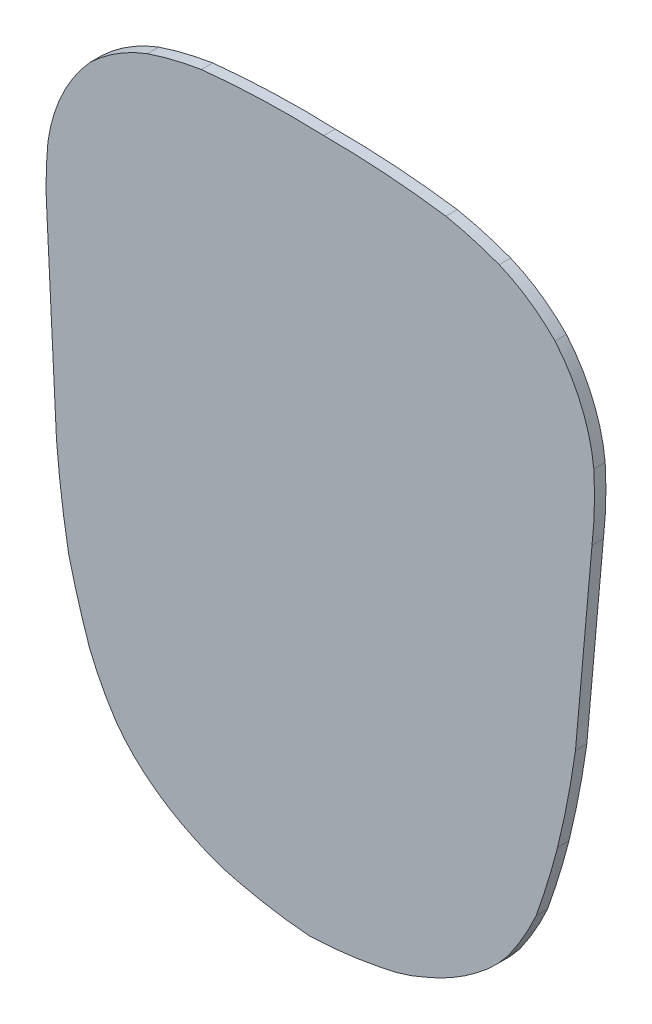
ISO-10303-21;
HEADER;
FILE_DESCRIPTION(('STEP AP214'),'2;1');
FILE_NAME('part.step','',(''),(''),'','','');
FILE_SCHEMA(('AUTOMOTIVE_DESIGN { 1 0 10303 214 1 1 1 1 }'));
ENDSEC;
DATA;
#1=APPLICATION_CONTEXT('core data for automotive mechanical design processes');
#2=APPLICATION_PROTOCOL_DEFINITION('international standard','automotive_design',2000,#1);
#3=PRODUCT_CONTEXT('',#1,'mechanical');
#4=PRODUCT('Part','Part','',(#3));
#5=PRODUCT_RELATED_PRODUCT_CATEGORY('part','',(#4));
#6=PRODUCT_DEFINITION_FORMATION('','',#4);
#7=PRODUCT_DEFINITION_CONTEXT('part definition',#1,'design');
#8=PRODUCT_DEFINITION('design','',#6,#7);
#9=PRODUCT_DEFINITION_SHAPE('','',#8);
#10=(LENGTH_UNIT() NAMED_UNIT(*) SI_UNIT(.MILLI.,.METRE.));
#11=(NAMED_UNIT(*) PLANE_ANGLE_UNIT() SI_UNIT($,.RADIAN.));
#12=(NAMED_UNIT(*) SI_UNIT($,.STERADIAN.) SOLID_ANGLE_UNIT());
#13=UNCERTAINTY_MEASURE_WITH_UNIT(LENGTH_MEASURE(1.E-05),#10,'distance_accuracy_value','');
#14=(GEOMETRIC_REPRESENTATION_CONTEXT(3) GLOBAL_UNCERTAINTY_ASSIGNED_CONTEXT((#13)) GLOBAL_UNIT_ASSIGNED_CONTEXT((#10,
#11,#12)) REPRESENTATION_CONTEXT('',''));
#15=CARTESIAN_POINT('',(0.,0.,0.));
#16=DIRECTION('',(0.,0.,1.));
#17=DIRECTION('',(1.,0.,0.));
#18=AXIS2_PLACEMENT_3D('',#15,#16,#17);
#19=CARTESIAN_POINT('',(-2.87645068487016,-22.2307778413905,37.7490965279302));
#20=DIRECTION('',(0.,0.,1.));
#21=DIRECTION('',(0.0193548335692301,0.999812677663925,0.));
#22=AXIS2_PLACEMENT_3D('',#19,#20,#21);
#23=PLANE('',#22);
#24=CARTESIAN_POINT('',(3.40605421210544,8.02001484887181,37.74909652793));
#25=DIRECTION('',(0.,0.,-1.));
#26=DIRECTION('',(-0.0193548335692301,-0.999812677663925,0.));
#27=AXIS2_PLACEMENT_3D('',#24,#25,#26);
#28=CIRCLE('',#27,7.43643173112);
#29=CARTESIAN_POINT('',(8.74976189327244,13.1916011731871,37.74909652793));
#30=VERTEX_POINT('',#29);
#31=CARTESIAN_POINT('',(6.29473617833669,14.8724621043842,37.74909652793));
#32=VERTEX_POINT('',#31);
#33=EDGE_CURVE('E399',#30,#32,#28,.F.);
#34=ORIENTED_EDGE('',*,*,#33,.F.);
#35=CARTESIAN_POINT('',(3.11803650286193,8.43130453548566,37.7490965279299));
#36=DIRECTION('',(0.,0.,-1.));
#37=DIRECTION('',(-0.0193548335692301,-0.999812677663925,0.));
#38=AXIS2_PLACEMENT_3D('',#35,#36,#37);
#39=CIRCLE('',#38,7.3740595978);
#40=CARTESIAN_POINT('',(10.4553019723894,9.16702892789532,37.7490965279302));
#41=VERTEX_POINT('',#40);
#42=EDGE_CURVE('E194',#41,#30,#39,.F.);
#43=ORIENTED_EDGE('',*,*,#42,.F.);
#44=CARTESIAN_POINT('',(-6.32552371849095,8.14421174061835,37.7490965279296));
#45=DIRECTION('',(0.,0.,-1.));
#46=DIRECTION('',(-0.0193548335692301,-0.999812677663925,0.));
#47=AXIS2_PLACEMENT_3D('',#44,#45,#46);
#48=CIRCLE('',#47,16.81196793556);
#49=CARTESIAN_POINT('',(10.3766044314373,6.2255713027891,37.7490965279302));
#50=VERTEX_POINT('',#49);
#51=EDGE_CURVE('E20',#50,#41,#48,.F.);
#52=ORIENTED_EDGE('',*,*,#51,.F.);
#53=DIRECTION('',(-0.0886995040357044,-0.996058431008854,0.));
#54=VECTOR('',#53,1.);
#55=CARTESIAN_POINT('',(10.3766044314373,6.22557130278913,37.7490965279302));
#56=LINE('',#55,#54);
#57=CARTESIAN_POINT('',(9.64811099468481,-1.95510611475094,37.7490965279302));
#58=VERTEX_POINT('',#57);
#59=EDGE_CURVE('E193',#50,#58,#56,.T.);
#60=ORIENTED_EDGE('',*,*,#59,.T.);
#61=CARTESIAN_POINT('',(-31.2814474166911,3.80134354731966,37.7490965279289));
#62=DIRECTION('',(0.,0.,-1.));
#63=DIRECTION('',(-0.0193548335692301,-0.999812677663925,0.));
#64=AXIS2_PLACEMENT_3D('',#61,#62,#63);
#65=CIRCLE('',#64,41.33237791928);
#66=CARTESIAN_POINT('',(8.86403234955447,-6.03257321052169,37.7490965279303));
#67=VERTEX_POINT('',#66);
#68=EDGE_CURVE('E206',#67,#58,#65,.F.);
#69=ORIENTED_EDGE('',*,*,#68,.F.);
#70=CARTESIAN_POINT('',(-24.973760623793,2.68335405814088,37.7490965279291));
#71=DIRECTION('',(0.,0.,-1.));
#72=DIRECTION('',(-0.0193548335692301,-0.999812677663925,0.));
#73=AXIS2_PLACEMENT_3D('',#70,#71,#72);
#74=CIRCLE('',#73,34.94228987144);
#75=CARTESIAN_POINT('',(7.91947678147986,-9.10641075970419,37.7490965279303));
#76=VERTEX_POINT('',#75);
#77=EDGE_CURVE('E320',#76,#67,#74,.F.);
#78=ORIENTED_EDGE('',*,*,#77,.F.);
#79=CARTESIAN_POINT('',(-3.58067037627299,-3.93497982202906,37.7490965279299));
#80=DIRECTION('',(0.,0.,-1.));
#81=DIRECTION('',(-0.0193548335692301,-0.999812677663925,0.));
#82=AXIS2_PLACEMENT_3D('',#79,#80,#81);
#83=CIRCLE('',#82,12.60940452968);
#84=CARTESIAN_POINT('',(6.6977668305515,-11.2391437836663,37.7490965279303));
#85=VERTEX_POINT('',#84);
#86=EDGE_CURVE('E324',#85,#76,#83,.F.);
#87=ORIENTED_EDGE('',*,*,#86,.F.);
#88=CARTESIAN_POINT('',(1.10266886694143,-6.8693447401081,37.74909652793));
#89=DIRECTION('',(0.,0.,-1.));
#90=DIRECTION('',(-0.0193548335692301,-0.999812677663925,0.));
#91=AXIS2_PLACEMENT_3D('',#88,#89,#90);
#92=CIRCLE('',#91,7.09931439672);
#93=CARTESIAN_POINT('',(5.30083998115867,-12.5943446701717,37.7490965279303));
#94=VERTEX_POINT('',#93);
#95=EDGE_CURVE('E328',#94,#85,#92,.F.);
#96=ORIENTED_EDGE('',*,*,#95,.F.);
#97=CARTESIAN_POINT('',(-0.638723059391806,-4.8395373063229,37.74909652793));
#98=DIRECTION('',(0.,0.,-1.));
#99=DIRECTION('',(-0.0193548335692301,-0.999812677663925,0.));
#100=AXIS2_PLACEMENT_3D('',#97,#98,#99);
#101=CIRCLE('',#100,9.76808304444);
#102=CARTESIAN_POINT('',(3.02325465351682,-13.8952187049387,37.7490965279302));
#103=VERTEX_POINT('',#102);
#104=EDGE_CURVE('E332',#103,#94,#101,.F.);
#105=ORIENTED_EDGE('',*,*,#104,.F.);
#106=CARTESIAN_POINT('',(-0.207770559998101,-6.83732878190939,37.74909652793));
#107=DIRECTION('',(0.,0.,-1.));
#108=DIRECTION('',(-0.0193548335692301,-0.999812677663925,0.));
#109=AXIS2_PLACEMENT_3D('',#106,#107,#108);
#110=CIRCLE('',#109,7.76230211316);
#111=CARTESIAN_POINT('',(1.1176538211111,-14.4856347581325,37.7490965279302));
#112=VERTEX_POINT('',#111);
#113=EDGE_CURVE('E336',#112,#103,#110,.F.);
#114=ORIENTED_EDGE('',*,*,#113,.F.);
#115=CARTESIAN_POINT('',(-2.80966912930586,4.75500909683406,37.7490965279298));
#116=DIRECTION('',(0.,0.,-1.));
#117=DIRECTION('',(-0.0193548335692301,-0.999812677663925,0.));
#118=AXIS2_PLACEMENT_3D('',#115,#116,#117);
#119=CIRCLE('',#118,19.6373684976);
#120=CARTESIAN_POINT('',(-2.01526832310904,-14.8662846645275,37.7490965279301));
#121=VERTEX_POINT('',#120);
#122=EDGE_CURVE('E340',#121,#112,#119,.F.);
#123=ORIENTED_EDGE('',*,*,#122,.F.);
#124=CARTESIAN_POINT('',(-0.523207579480535,4.71400533480674,37.7490965279299));
#125=DIRECTION('',(0.,0.,-1.));
#126=DIRECTION('',(-0.0193548335692301,-0.999812677663925,0.));
#127=AXIS2_PLACEMENT_3D('',#124,#125,#126);
#128=CIRCLE('',#127,19.63705684976);
#129=CARTESIAN_POINT('',(-5.17633782189552,-14.3637927736708,37.74909652793));
#130=VERTEX_POINT('',#129);
#131=EDGE_CURVE('E344',#130,#121,#128,.F.);
#132=ORIENTED_EDGE('',*,*,#131,.F.);
#133=CARTESIAN_POINT('',(-3.55589855490548,-6.77251418057695,37.7490965279299));
#134=DIRECTION('',(0.,0.,-1.));
#135=DIRECTION('',(-0.0193548335692301,-0.999812677663925,0.));
#136=AXIS2_PLACEMENT_3D('',#133,#134,#135);
#137=CIRCLE('',#136,7.76230211316);
#138=CARTESIAN_POINT('',(-7.05766041396077,-13.7000677154429,37.7490965279299));
#139=VERTEX_POINT('',#138);
#140=EDGE_CURVE('E348',#139,#130,#137,.F.);
#141=ORIENTED_EDGE('',*,*,#140,.F.);
#142=CARTESIAN_POINT('',(-3.04794957670766,-4.7928983915392,37.7490965279299));
#143=DIRECTION('',(0.,0.,-1.));
#144=DIRECTION('',(-0.0193548335692301,-0.999812677663925,0.));
#145=AXIS2_PLACEMENT_3D('',#142,#143,#144);
#146=CIRCLE('',#145,9.76808304444);
#147=CARTESIAN_POINT('',(-9.28319236302824,-12.3120202657153,37.7490965279298));
#148=VERTEX_POINT('',#147);
#149=EDGE_CURVE('E352',#148,#139,#146,.F.);
#150=ORIENTED_EDGE('',*,*,#149,.F.);
#151=CARTESIAN_POINT('',(-4.76167465689586,-6.83879977530864,37.7490965279299));
#152=DIRECTION('',(0.,0.,-1.));
#153=DIRECTION('',(-0.0193548335692301,-0.999812677663925,0.));
#154=AXIS2_PLACEMENT_3D('',#151,#152,#153);
#155=CIRCLE('',#154,7.09931439672);
#156=CARTESIAN_POINT('',(-10.5813963887554,-10.9046457963968,37.7490965279298));
#157=VERTEX_POINT('',#156);
#158=EDGE_CURVE('E356',#157,#148,#155,.F.);
#159=ORIENTED_EDGE('',*,*,#158,.F.);
#160=CARTESIAN_POINT('',(-0.0279711922388365,-4.00375460651088,37.74909652793));
#161=DIRECTION('',(0.,0.,-1.));
#162=DIRECTION('',(-0.0193548335692301,-0.999812677663925,0.));
#163=AXIS2_PLACEMENT_3D('',#160,#161,#162);
#164=CIRCLE('',#163,12.60940452968);
#165=CARTESIAN_POINT('',(-11.7196490905639,-8.72622753019508,37.7490965279297));
#166=VERTEX_POINT('',#165);
#167=EDGE_CURVE('E360',#166,#157,#164,.F.);
#168=ORIENTED_EDGE('',*,*,#167,.F.);
#169=CARTESIAN_POINT('',(21.3074102324667,2.68328490166428,37.7490965279306));
#170=DIRECTION('',(0.,0.,-1.));
#171=DIRECTION('',(-0.0193548335692301,-0.999812677663925,0.));
#172=AXIS2_PLACEMENT_3D('',#169,#170,#171);
#173=CIRCLE('',#172,34.94228987144);
#174=CARTESIAN_POINT('',(-12.6348799299236,-5.61638738053116,37.7490965279296));
#175=VERTEX_POINT('',#174);
#176=EDGE_CURVE('E363',#175,#166,#173,.F.);
#177=ORIENTED_EDGE('',*,*,#176,.F.);
#178=CARTESIAN_POINT('',(28.0310735031444,1.77588533100571,37.7490965279308));
#179=DIRECTION('',(0.,0.,-1.));
#180=DIRECTION('',(-0.0193548335692301,-0.999812677663925,0.));
#181=AXIS2_PLACEMENT_3D('',#178,#179,#180);
#182=CIRCLE('',#181,41.33237791928);
#183=CARTESIAN_POINT('',(-13.1702154109103,-1.51337845938621,37.7490965279296));
#184=VERTEX_POINT('',#183);
#185=EDGE_CURVE('E367',#184,#175,#182,.F.);
#186=ORIENTED_EDGE('',*,*,#185,.F.);
#187=DIRECTION('',(-0.0500831809567765,0.998745050042928,0.));
#188=VECTOR('',#187,1.);
#189=CARTESIAN_POINT('',(-13.1702154109103,-1.51337845938582,37.7490965279296));
#190=LINE('',#189,#188);
#191=CARTESIAN_POINT('',(-13.5815510662259,6.68936429385876,37.7490965279294));
#192=VERTEX_POINT('',#191);
#193=EDGE_CURVE('E219',#184,#192,#190,.T.);
#194=ORIENTED_EDGE('',*,*,#193,.T.);
#195=CARTESIAN_POINT('',(3.18231954948581,7.96015453853926,37.74909652793));
#196=DIRECTION('',(0.,0.,-1.));
#197=DIRECTION('',(-0.0193548335692301,-0.999812677663925,0.));
#198=AXIS2_PLACEMENT_3D('',#195,#196,#197);
#199=CIRCLE('',#198,16.81196793556);
#200=CARTESIAN_POINT('',(-13.5463481289565,9.63166390750369,37.7490965279294));
#201=VERTEX_POINT('',#200);
#202=EDGE_CURVE('E223',#201,#192,#199,.F.);
#203=ORIENTED_EDGE('',*,*,#202,.F.);
#204=CARTESIAN_POINT('',(-6.24305419079941,8.61252083374827,37.7490965279296));
#205=DIRECTION('',(0.,0.,-1.));
#206=DIRECTION('',(-0.0193548335692301,-0.999812677663925,0.));
#207=AXIS2_PLACEMENT_3D('',#204,#205,#206);
#208=CIRCLE('',#207,7.3740595978);
#209=CARTESIAN_POINT('',(-11.6863252040826,13.5872123445715,37.7490965279294));
#210=VERTEX_POINT('',#209);
#211=EDGE_CURVE('E375',#210,#201,#208,.F.);
#212=ORIENTED_EDGE('',*,*,#211,.F.);
#213=CARTESIAN_POINT('',(-6.54677401618388,8.21268627443502,37.7490965279296));
#214=DIRECTION('',(0.,0.,-1.));
#215=DIRECTION('',(-0.0193548335692301,-0.999812677663925,0.));
#216=AXIS2_PLACEMENT_3D('',#213,#214,#215);
#217=CIRCLE('',#216,7.43643173112);
#218=CARTESIAN_POINT('',(-9.16808546254458,15.17179851615,37.7490965279295));
#219=VERTEX_POINT('',#218);
#220=EDGE_CURVE('E379',#219,#210,#217,.F.);
#221=ORIENTED_EDGE('',*,*,#220,.F.);
#222=CARTESIAN_POINT('',(-4.43670572158507,1.02428534892829,37.7490965279298));
#223=DIRECTION('',(0.,0.,-1.));
#224=DIRECTION('',(-0.0193548335692301,-0.999812677663925,0.));
#225=AXIS2_PLACEMENT_3D('',#222,#223,#224);
#226=CIRCLE('',#225,14.91771038296);
#227=CARTESIAN_POINT('',(-6.80003650135269,15.7536013783736,37.7490965279295));
#228=VERTEX_POINT('',#227);
#229=EDGE_CURVE('E383',#228,#219,#226,.F.);
#230=ORIENTED_EDGE('',*,*,#229,.F.);
#231=CARTESIAN_POINT('',(-2.87645068487016,-22.2307778413905,37.7490965279302));
#232=DIRECTION('',(0.,0.,-1.));
#233=DIRECTION('',(-0.0193548335692301,-0.999812677663925,0.));
#234=AXIS2_PLACEMENT_3D('',#231,#232,#233);
#235=CIRCLE('',#234,38.18648439396);
#236=CARTESIAN_POINT('',(-1.41914055333809,15.9278887698878,37.7490965279297));
#237=VERTEX_POINT('',#236);
#238=EDGE_CURVE('E387',#237,#228,#235,.F.);
#239=ORIENTED_EDGE('',*,*,#238,.F.);
#240=CARTESIAN_POINT('',(-1.43975485684205,-22.2585901013477,37.7490965279302));
#241=DIRECTION('',(0.,0.,-1.));
#242=DIRECTION('',(-0.0193548335692301,-0.999812677663925,0.));
#243=AXIS2_PLACEMENT_3D('',#240,#241,#242);
#244=CIRCLE('',#243,38.186484435371);
#245=CARTESIAN_POINT('',(3.95097858118662,15.5454782846467,37.7490965279299));
#246=VERTEX_POINT('',#245);
#247=EDGE_CURVE('E391',#246,#237,#244,.F.);
#248=ORIENTED_EDGE('',*,*,#247,.F.);
#249=CARTESIAN_POINT('',(1.01935833845516,0.918664351931265,37.74909652793));
#250=DIRECTION('',(0.,0.,-1.));
#251=DIRECTION('',(-0.0193548335692301,-0.999812677663925,0.));
#252=AXIS2_PLACEMENT_3D('',#249,#250,#251);
#253=CIRCLE('',#252,14.91771038296);
#254=EDGE_CURVE('E395',#32,#246,#253,.F.);
#255=ORIENTED_EDGE('',*,*,#254,.F.);
#256=EDGE_LOOP('',(#34,#43,#52,#60,#69,#78,#87,#96,#105,#114,#123,#132,#141,#150,#159,#168,#177,
#186,#194,#203,#212,#221,#230,#239,#248,#255));
#257=FACE_BOUND('',#256,.T.);
#258=ADVANCED_FACE('F17',(#257),#23,.F.);
#259=CARTESIAN_POINT('',(-6.32552371849096,8.14421174061835,38.1300965279296));
#260=DIRECTION('',(0.,0.,-1.));
#261=DIRECTION('',(-0.0193548335692301,-0.999812677663925,0.));
#262=AXIS2_PLACEMENT_3D('',#259,#260,#261);
#263=CYLINDRICAL_SURFACE('',#262,16.81196793556);
#264=DIRECTION('',(0.,0.,-1.));
#265=VECTOR('',#264,1.);
#266=CARTESIAN_POINT('',(10.4553019723893,9.16702892789537,38.1300965279302));
#267=LINE('',#266,#265);
#268=CARTESIAN_POINT('',(10.4553019723893,9.16702892789536,38.2500965279301));
#269=VERTEX_POINT('',#268);
#270=EDGE_CURVE('E198',#269,#41,#267,.T.);
#271=ORIENTED_EDGE('',*,*,#270,.F.);
#272=CARTESIAN_POINT('',(-6.32552371849096,8.14421174061835,38.2500965279296));
#273=DIRECTION('',(0.,0.,-1.));
#274=DIRECTION('',(-0.0193548335692301,-0.999812677663925,0.));
#275=AXIS2_PLACEMENT_3D('',#272,#273,#274);
#276=CIRCLE('',#275,16.81196793556);
#277=CARTESIAN_POINT('',(10.3766044314372,6.22557130278923,38.2500965279302));
#278=VERTEX_POINT('',#277);
#279=EDGE_CURVE('E203',#278,#269,#276,.F.);
#280=ORIENTED_EDGE('',*,*,#279,.F.);
#281=DIRECTION('',(0.,0.,1.));
#282=VECTOR('',#281,1.);
#283=CARTESIAN_POINT('',(10.3766044314372,6.22557130278915,38.1300965279302));
#284=LINE('',#283,#282);
#285=EDGE_CURVE('E200',#278,#50,#284,.F.);
#286=ORIENTED_EDGE('',*,*,#285,.T.);
#287=ORIENTED_EDGE('',*,*,#51,.T.);
#288=EDGE_LOOP('',(#271,#280,#286,#287));
#289=FACE_BOUND('',#288,.T.);
#290=ADVANCED_FACE('F201',(#289),#263,.T.);
#291=CARTESIAN_POINT('',(3.11803650286192,8.43130453548566,38.1300965279299));
#292=DIRECTION('',(0.,0.,-1.));
#293=DIRECTION('',(-0.0193548335692301,-0.999812677663925,0.));
#294=AXIS2_PLACEMENT_3D('',#291,#292,#293);
#295=CYLINDRICAL_SURFACE('',#294,7.3740595978);
#296=DIRECTION('',(0.,0.,-1.));
#297=VECTOR('',#296,1.);
#298=CARTESIAN_POINT('',(8.74976189327242,13.1916011731871,38.13009652793));
#299=LINE('',#298,#297);
#300=CARTESIAN_POINT('',(8.74976189327242,13.1916011731871,38.25009652793));
#301=VERTEX_POINT('',#300);
#302=EDGE_CURVE('E401',#301,#30,#299,.T.);
#303=ORIENTED_EDGE('',*,*,#302,.F.);
#304=CARTESIAN_POINT('',(3.11803650286191,8.43130453548566,38.2500965279299));
#305=DIRECTION('',(0.,0.,-1.));
#306=DIRECTION('',(-0.0193548335692301,-0.999812677663925,0.));
#307=AXIS2_PLACEMENT_3D('',#304,#305,#306);
#308=CIRCLE('',#307,7.3740595978);
#309=EDGE_CURVE('E311',#269,#301,#308,.F.);
#310=ORIENTED_EDGE('',*,*,#309,.F.);
#311=ORIENTED_EDGE('',*,*,#270,.T.);
#312=ORIENTED_EDGE('',*,*,#42,.T.);
#313=EDGE_LOOP('',(#303,#310,#311,#312));
#314=FACE_BOUND('',#313,.T.);
#315=ADVANCED_FACE('F409',(#314),#295,.T.);
#316=CARTESIAN_POINT('',(3.40605421210543,8.02001484887182,38.13009652793));
#317=DIRECTION('',(0.,0.,-1.));
#318=DIRECTION('',(-0.0193548335692301,-0.999812677663925,0.));
#319=AXIS2_PLACEMENT_3D('',#316,#317,#318);
#320=CYLINDRICAL_SURFACE('',#319,7.43643173112);
#321=DIRECTION('',(0.,0.,-1.));
#322=VECTOR('',#321,1.);
#323=CARTESIAN_POINT('',(6.29473617833669,14.8724621043842,38.13009652793));
#324=LINE('',#323,#322);
#325=CARTESIAN_POINT('',(6.29473617833668,14.8724621043842,38.2500965279299));
#326=VERTEX_POINT('',#325);
#327=EDGE_CURVE('E398',#326,#32,#324,.T.);
#328=ORIENTED_EDGE('',*,*,#327,.F.);
#329=CARTESIAN_POINT('',(3.40605421210542,8.02001484887182,38.2500965279299));
#330=DIRECTION('',(0.,0.,-1.));
#331=DIRECTION('',(-0.0193548335692301,-0.999812677663925,0.));
#332=AXIS2_PLACEMENT_3D('',#329,#330,#331);
#333=CIRCLE('',#332,7.43643173112);
#334=EDGE_CURVE('E307',#301,#326,#333,.F.);
#335=ORIENTED_EDGE('',*,*,#334,.F.);
#336=ORIENTED_EDGE('',*,*,#302,.T.);
#337=ORIENTED_EDGE('',*,*,#33,.T.);
#338=EDGE_LOOP('',(#328,#335,#336,#337));
#339=FACE_BOUND('',#338,.T.);
#340=ADVANCED_FACE('F486',(#339),#320,.T.);
#341=CARTESIAN_POINT('',(1.01935833845515,0.918664351931272,38.13009652793));
#342=DIRECTION('',(0.,0.,-1.));
#343=DIRECTION('',(-0.0193548335692301,-0.999812677663925,0.));
#344=AXIS2_PLACEMENT_3D('',#341,#342,#343);
#345=CYLINDRICAL_SURFACE('',#344,14.91771038296);
#346=DIRECTION('',(0.,0.,-1.));
#347=VECTOR('',#346,1.);
#348=CARTESIAN_POINT('',(3.95097858118664,15.5454782846467,38.1300965279299));
#349=LINE('',#348,#347);
#350=CARTESIAN_POINT('',(3.95097858118661,15.5454782846467,38.2500965279298));
#351=VERTEX_POINT('',#350);
#352=EDGE_CURVE('E394',#351,#246,#349,.T.);
#353=ORIENTED_EDGE('',*,*,#352,.F.);
#354=CARTESIAN_POINT('',(1.01935833845515,0.918664351931274,38.2500965279299));
#355=DIRECTION('',(0.,0.,-1.));
#356=DIRECTION('',(-0.0193548335692301,-0.999812677663925,0.));
#357=AXIS2_PLACEMENT_3D('',#354,#355,#356);
#358=CIRCLE('',#357,14.91771038296);
#359=EDGE_CURVE('E303',#326,#351,#358,.F.);
#360=ORIENTED_EDGE('',*,*,#359,.F.);
#361=ORIENTED_EDGE('',*,*,#327,.T.);
#362=ORIENTED_EDGE('',*,*,#254,.T.);
#363=EDGE_LOOP('',(#353,#360,#361,#362));
#364=FACE_BOUND('',#363,.T.);
#365=ADVANCED_FACE('F482',(#364),#345,.T.);
#366=CARTESIAN_POINT('',(-1.43975485684206,-22.2585901013477,38.1300965279302));
#367=DIRECTION('',(0.,0.,-1.));
#368=DIRECTION('',(-0.0193548335692301,-0.999812677663925,0.));
#369=AXIS2_PLACEMENT_3D('',#366,#367,#368);
#370=CYLINDRICAL_SURFACE('',#369,38.186484435371);
#371=DIRECTION('',(0.,0.,-1.));
#372=VECTOR('',#371,1.);
#373=CARTESIAN_POINT('',(-1.41914055333799,15.9278887698878,38.1300965279297));
#374=LINE('',#373,#372);
#375=CARTESIAN_POINT('',(-1.4191405533381,15.9278887698878,38.2500965279296));
#376=VERTEX_POINT('',#375);
#377=EDGE_CURVE('E390',#376,#237,#374,.T.);
#378=ORIENTED_EDGE('',*,*,#377,.F.);
#379=CARTESIAN_POINT('',(-1.43975485684206,-22.2585901013477,38.2500965279302));
#380=DIRECTION('',(0.,0.,-1.));
#381=DIRECTION('',(-0.0193548335692301,-0.999812677663925,0.));
#382=AXIS2_PLACEMENT_3D('',#379,#380,#381);
#383=CIRCLE('',#382,38.186484435371);
#384=EDGE_CURVE('E299',#351,#376,#383,.F.);
#385=ORIENTED_EDGE('',*,*,#384,.F.);
#386=ORIENTED_EDGE('',*,*,#352,.T.);
#387=ORIENTED_EDGE('',*,*,#247,.T.);
#388=EDGE_LOOP('',(#378,#385,#386,#387));
#389=FACE_BOUND('',#388,.T.);
#390=ADVANCED_FACE('F491',(#389),#370,.T.);
#391=CARTESIAN_POINT('',(-2.87645068487017,-22.2307778413905,38.1300965279302));
#392=DIRECTION('',(0.,0.,-1.));
#393=DIRECTION('',(-0.0193548335692301,-0.999812677663925,0.));
#394=AXIS2_PLACEMENT_3D('',#391,#392,#393);
#395=CYLINDRICAL_SURFACE('',#394,38.18648439396);
#396=DIRECTION('',(0.,0.,-1.));
#397=VECTOR('',#396,1.);
#398=CARTESIAN_POINT('',(-6.80003650135271,15.7536013783736,38.1300965279295));
#399=LINE('',#398,#397);
#400=CARTESIAN_POINT('',(-6.80003650135273,15.7536013783736,38.2500965279295));
#401=VERTEX_POINT('',#400);
#402=EDGE_CURVE('E386',#401,#228,#399,.T.);
#403=ORIENTED_EDGE('',*,*,#402,.F.);
#404=CARTESIAN_POINT('',(-2.87645068487018,-22.2307778413905,38.2500965279301));
#405=DIRECTION('',(0.,0.,-1.));
#406=DIRECTION('',(-0.0193548335692301,-0.999812677663925,0.));
#407=AXIS2_PLACEMENT_3D('',#404,#405,#406);
#408=CIRCLE('',#407,38.18648439396);
#409=EDGE_CURVE('E295',#376,#401,#408,.F.);
#410=ORIENTED_EDGE('',*,*,#409,.F.);
#411=ORIENTED_EDGE('',*,*,#377,.T.);
#412=ORIENTED_EDGE('',*,*,#238,.T.);
#413=EDGE_LOOP('',(#403,#410,#411,#412));
#414=FACE_BOUND('',#413,.T.);
#415=ADVANCED_FACE('F495',(#414),#395,.T.);
#416=CARTESIAN_POINT('',(-4.43670572158509,1.0242853489283,38.1300965279298));
#417=DIRECTION('',(0.,0.,-1.));
#418=DIRECTION('',(-0.0193548335692301,-0.999812677663925,0.));
#419=AXIS2_PLACEMENT_3D('',#416,#417,#418);
#420=CYLINDRICAL_SURFACE('',#419,14.91771038296);
#421=DIRECTION('',(0.,0.,-1.));
#422=VECTOR('',#421,1.);
#423=CARTESIAN_POINT('',(-9.16808546254456,15.17179851615,38.1300965279295));
#424=LINE('',#423,#422);
#425=CARTESIAN_POINT('',(-9.16808546254458,15.17179851615,38.2500965279295));
#426=VERTEX_POINT('',#425);
#427=EDGE_CURVE('E382',#426,#219,#424,.T.);
#428=ORIENTED_EDGE('',*,*,#427,.F.);
#429=CARTESIAN_POINT('',(-4.43670572158509,1.0242853489283,38.2500965279298));
#430=DIRECTION('',(0.,0.,-1.));
#431=DIRECTION('',(-0.0193548335692301,-0.999812677663925,0.));
#432=AXIS2_PLACEMENT_3D('',#429,#430,#431);
#433=CIRCLE('',#432,14.91771038296);
#434=EDGE_CURVE('E291',#401,#426,#433,.F.);
#435=ORIENTED_EDGE('',*,*,#434,.F.);
#436=ORIENTED_EDGE('',*,*,#402,.T.);
#437=ORIENTED_EDGE('',*,*,#229,.T.);
#438=EDGE_LOOP('',(#428,#435,#436,#437));
#439=FACE_BOUND('',#438,.T.);
#440=ADVANCED_FACE('F497',(#439),#420,.T.);
#441=CARTESIAN_POINT('',(-6.5467740161839,8.21268627443503,38.1300965279296));
#442=DIRECTION('',(0.,0.,-1.));
#443=DIRECTION('',(-0.0193548335692301,-0.999812677663925,0.));
#444=AXIS2_PLACEMENT_3D('',#441,#442,#443);
#445=CYLINDRICAL_SURFACE('',#444,7.43643173112);
#446=DIRECTION('',(0.,0.,-1.));
#447=VECTOR('',#446,1.);
#448=CARTESIAN_POINT('',(-11.6863252040826,13.5872123445715,38.1300965279294));
#449=LINE('',#448,#447);
#450=CARTESIAN_POINT('',(-11.6863252040826,13.5872123445715,38.2500965279294));
#451=VERTEX_POINT('',#450);
#452=EDGE_CURVE('E378',#451,#210,#449,.T.);
#453=ORIENTED_EDGE('',*,*,#452,.F.);
#454=CARTESIAN_POINT('',(-6.5467740161839,8.21268627443503,38.2500965279296));
#455=DIRECTION('',(0.,0.,-1.));
#456=DIRECTION('',(-0.0193548335692301,-0.999812677663925,0.));
#457=AXIS2_PLACEMENT_3D('',#454,#455,#456);
#458=CIRCLE('',#457,7.43643173112);
#459=EDGE_CURVE('E287',#426,#451,#458,.F.);
#460=ORIENTED_EDGE('',*,*,#459,.F.);
#461=ORIENTED_EDGE('',*,*,#427,.T.);
#462=ORIENTED_EDGE('',*,*,#220,.T.);
#463=EDGE_LOOP('',(#453,#460,#461,#462));
#464=FACE_BOUND('',#463,.T.);
#465=ADVANCED_FACE('F501',(#464),#445,.T.);
#466=CARTESIAN_POINT('',(-6.24305419079942,8.61252083374827,38.1300965279296));
#467=DIRECTION('',(0.,0.,-1.));
#468=DIRECTION('',(-0.0193548335692301,-0.999812677663925,0.));
#469=AXIS2_PLACEMENT_3D('',#466,#467,#468);
#470=CYLINDRICAL_SURFACE('',#469,7.3740595978);
#471=DIRECTION('',(0.,0.,-1.));
#472=VECTOR('',#471,1.);
#473=CARTESIAN_POINT('',(-13.5463481289565,9.6316639075037,38.1300965279294));
#474=LINE('',#473,#472);
#475=CARTESIAN_POINT('',(-13.5463481289566,9.63166390750369,38.2500965279294));
#476=VERTEX_POINT('',#475);
#477=EDGE_CURVE('E374',#476,#201,#474,.T.);
#478=ORIENTED_EDGE('',*,*,#477,.F.);
#479=CARTESIAN_POINT('',(-6.24305419079943,8.61252083374827,38.2500965279296));
#480=DIRECTION('',(0.,0.,-1.));
#481=DIRECTION('',(-0.0193548335692301,-0.999812677663925,0.));
#482=AXIS2_PLACEMENT_3D('',#479,#480,#481);
#483=CIRCLE('',#482,7.3740595978);
#484=EDGE_CURVE('E283',#451,#476,#483,.F.);
#485=ORIENTED_EDGE('',*,*,#484,.F.);
#486=ORIENTED_EDGE('',*,*,#452,.T.);
#487=ORIENTED_EDGE('',*,*,#211,.T.);
#488=EDGE_LOOP('',(#478,#485,#486,#487));
#489=FACE_BOUND('',#488,.T.);
#490=ADVANCED_FACE('F506',(#489),#470,.T.);
#491=CARTESIAN_POINT('',(3.1823195494858,7.96015453853927,38.13009652793));
#492=DIRECTION('',(0.,0.,-1.));
#493=DIRECTION('',(-0.0193548335692301,-0.999812677663925,0.));
#494=AXIS2_PLACEMENT_3D('',#491,#492,#493);
#495=CYLINDRICAL_SURFACE('',#494,16.81196793556);
#496=DIRECTION('',(0.,0.,1.));
#497=VECTOR('',#496,1.);
#498=CARTESIAN_POINT('',(-13.5815510662259,6.68936429385879,38.1300965279294));
#499=LINE('',#498,#497);
#500=CARTESIAN_POINT('',(-13.5815510662259,6.68936429385877,38.2500965279294));
#501=VERTEX_POINT('',#500);
#502=EDGE_CURVE('E222',#192,#501,#499,.T.);
#503=ORIENTED_EDGE('',*,*,#502,.T.);
#504=CARTESIAN_POINT('',(3.1823195494858,7.96015453853927,38.2500965279299));
#505=DIRECTION('',(0.,0.,-1.));
#506=DIRECTION('',(-0.0193548335692301,-0.999812677663925,0.));
#507=AXIS2_PLACEMENT_3D('',#504,#505,#506);
#508=CIRCLE('',#507,16.81196793556);
#509=EDGE_CURVE('E279',#476,#501,#508,.F.);
#510=ORIENTED_EDGE('',*,*,#509,.F.);
#511=ORIENTED_EDGE('',*,*,#477,.T.);
#512=ORIENTED_EDGE('',*,*,#202,.T.);
#513=EDGE_LOOP('',(#503,#510,#511,#512));
#514=FACE_BOUND('',#513,.T.);
#515=ADVANCED_FACE('F510',(#514),#495,.T.);
#516=CARTESIAN_POINT('',(-13.1702154109103,-1.51337845938581,38.1300965279296));
#517=DIRECTION('',(0.998745050042928,0.0500831809567765,0.));
#518=DIRECTION('',(-0.0500831809567765,0.998745050042928,0.));
#519=AXIS2_PLACEMENT_3D('',#516,#517,#518);
#520=PLANE('',#519);
#521=ORIENTED_EDGE('',*,*,#502,.F.);
#522=ORIENTED_EDGE('',*,*,#193,.F.);
#523=DIRECTION('',(0.,0.,-1.));
#524=VECTOR('',#523,1.);
#525=CARTESIAN_POINT('',(-13.1702154109103,-1.51337845938602,38.1300965279296));
#526=LINE('',#525,#524);
#527=CARTESIAN_POINT('',(-13.1702154109103,-1.51337845938607,38.2500965279295));
#528=VERTEX_POINT('',#527);
#529=EDGE_CURVE('E370',#528,#184,#526,.T.);
#530=ORIENTED_EDGE('',*,*,#529,.F.);
#531=DIRECTION('',(0.050083180956776,-0.998745050042928,0.));
#532=VECTOR('',#531,1.);
#533=CARTESIAN_POINT('',(-13.5815510662259,6.68936429385873,38.2500965279294));
#534=LINE('',#533,#532);
#535=EDGE_CURVE('E278',#501,#528,#534,.T.);
#536=ORIENTED_EDGE('',*,*,#535,.F.);
#537=EDGE_LOOP('',(#521,#522,#530,#536));
#538=FACE_BOUND('',#537,.T.);
#539=ADVANCED_FACE('F514',(#538),#520,.F.);
#540=CARTESIAN_POINT('',(28.0310735031444,1.77588533100572,38.1300965279308));
#541=DIRECTION('',(0.,0.,-1.));
#542=DIRECTION('',(-0.0193548335692301,-0.999812677663925,0.));
#543=AXIS2_PLACEMENT_3D('',#540,#541,#542);
#544=CYLINDRICAL_SURFACE('',#543,41.33237791928);
#545=DIRECTION('',(0.,0.,-1.));
#546=VECTOR('',#545,1.);
#547=CARTESIAN_POINT('',(-12.6348799299236,-5.61638738053124,38.1300965279296));
#548=LINE('',#547,#546);
#549=CARTESIAN_POINT('',(-12.6348799299236,-5.61638738053115,38.2500965279296));
#550=VERTEX_POINT('',#549);
#551=EDGE_CURVE('E366',#550,#175,#548,.T.);
#552=ORIENTED_EDGE('',*,*,#551,.F.);
#553=CARTESIAN_POINT('',(28.0310735031444,1.77588533100572,38.2500965279308));
#554=DIRECTION('',(0.,0.,-1.));
#555=DIRECTION('',(-0.0193548335692301,-0.999812677663925,0.));
#556=AXIS2_PLACEMENT_3D('',#553,#554,#555);
#557=CIRCLE('',#556,41.33237791928);
#558=EDGE_CURVE('E274',#528,#550,#557,.F.);
#559=ORIENTED_EDGE('',*,*,#558,.F.);
#560=ORIENTED_EDGE('',*,*,#529,.T.);
#561=ORIENTED_EDGE('',*,*,#185,.T.);
#562=EDGE_LOOP('',(#552,#559,#560,#561));
#563=FACE_BOUND('',#562,.T.);
#564=ADVANCED_FACE('F522',(#563),#544,.T.);
#565=CARTESIAN_POINT('',(21.3074102324666,2.68328490166428,38.1300965279306));
#566=DIRECTION('',(0.,0.,-1.));
#567=DIRECTION('',(-0.0193548335692301,-0.999812677663925,0.));
#568=AXIS2_PLACEMENT_3D('',#565,#566,#567);
#569=CYLINDRICAL_SURFACE('',#568,34.94228987144);
#570=DIRECTION('',(0.,0.,-1.));
#571=VECTOR('',#570,1.);
#572=CARTESIAN_POINT('',(-11.719649090564,-8.72622753019503,38.1300965279297));
#573=LINE('',#572,#571);
#574=CARTESIAN_POINT('',(-11.719649090564,-8.72622753019504,38.2500965279297));
#575=VERTEX_POINT('',#574);
#576=EDGE_CURVE('E362',#575,#166,#573,.T.);
#577=ORIENTED_EDGE('',*,*,#576,.F.);
#578=CARTESIAN_POINT('',(21.3074102324666,2.68328490166428,38.2500965279306));
#579=DIRECTION('',(0.,0.,-1.));
#580=DIRECTION('',(-0.0193548335692301,-0.999812677663925,0.));
#581=AXIS2_PLACEMENT_3D('',#578,#579,#580);
#582=CIRCLE('',#581,34.94228987144);
#583=EDGE_CURVE('E270',#550,#575,#582,.F.);
#584=ORIENTED_EDGE('',*,*,#583,.F.);
#585=ORIENTED_EDGE('',*,*,#551,.T.);
#586=ORIENTED_EDGE('',*,*,#176,.T.);
#587=EDGE_LOOP('',(#577,#584,#585,#586));
#588=FACE_BOUND('',#587,.T.);
#589=ADVANCED_FACE('F526',(#588),#569,.T.);
#590=CARTESIAN_POINT('',(-0.0279711922388487,-4.00375460651087,38.13009652793));
#591=DIRECTION('',(0.,0.,-1.));
#592=DIRECTION('',(-0.0193548335692301,-0.999812677663925,0.));
#593=AXIS2_PLACEMENT_3D('',#590,#591,#592);
#594=CYLINDRICAL_SURFACE('',#593,12.60940452968);
#595=DIRECTION('',(0.,0.,-1.));
#596=VECTOR('',#595,1.);
#597=CARTESIAN_POINT('',(-10.5813963887554,-10.9046457963967,38.1300965279298));
#598=LINE('',#597,#596);
#599=CARTESIAN_POINT('',(-10.5813963887554,-10.9046457963968,38.2500965279297));
#600=VERTEX_POINT('',#599);
#601=EDGE_CURVE('E359',#600,#157,#598,.T.);
#602=ORIENTED_EDGE('',*,*,#601,.F.);
#603=CARTESIAN_POINT('',(-0.0279711922388526,-4.00375460651087,38.25009652793));
#604=DIRECTION('',(0.,0.,-1.));
#605=DIRECTION('',(-0.0193548335692301,-0.999812677663925,0.));
#606=AXIS2_PLACEMENT_3D('',#603,#604,#605);
#607=CIRCLE('',#606,12.60940452968);
#608=EDGE_CURVE('E266',#575,#600,#607,.F.);
#609=ORIENTED_EDGE('',*,*,#608,.F.);
#610=ORIENTED_EDGE('',*,*,#576,.T.);
#611=ORIENTED_EDGE('',*,*,#167,.T.);
#612=EDGE_LOOP('',(#602,#609,#610,#611));
#613=FACE_BOUND('',#612,.T.);
#614=ADVANCED_FACE('F530',(#613),#594,.T.);
#615=CARTESIAN_POINT('',(-4.76167465689587,-6.83879977530864,38.1300965279299));
#616=DIRECTION('',(0.,0.,-1.));
#617=DIRECTION('',(-0.0193548335692301,-0.999812677663925,0.));
#618=AXIS2_PLACEMENT_3D('',#615,#616,#617);
#619=CYLINDRICAL_SURFACE('',#618,7.09931439672);
#620=DIRECTION('',(0.,0.,-1.));
#621=VECTOR('',#620,1.);
#622=CARTESIAN_POINT('',(-9.28319236302893,-12.3120202657147,38.1300965279298));
#623=LINE('',#622,#621);
#624=CARTESIAN_POINT('',(-9.2831923630282,-12.3120202657153,38.2500965279298));
#625=VERTEX_POINT('',#624);
#626=EDGE_CURVE('E355',#625,#148,#623,.T.);
#627=ORIENTED_EDGE('',*,*,#626,.F.);
#628=CARTESIAN_POINT('',(-4.76167465689588,-6.83879977530864,38.2500965279299));
#629=DIRECTION('',(0.,0.,-1.));
#630=DIRECTION('',(-0.0193548335692301,-0.999812677663925,0.));
#631=AXIS2_PLACEMENT_3D('',#628,#629,#630);
#632=CIRCLE('',#631,7.09931439672);
#633=EDGE_CURVE('E262',#600,#625,#632,.F.);
#634=ORIENTED_EDGE('',*,*,#633,.F.);
#635=ORIENTED_EDGE('',*,*,#601,.T.);
#636=ORIENTED_EDGE('',*,*,#158,.T.);
#637=EDGE_LOOP('',(#627,#634,#635,#636));
#638=FACE_BOUND('',#637,.T.);
#639=ADVANCED_FACE('F534',(#638),#619,.T.);
#640=CARTESIAN_POINT('',(-3.04794957670768,-4.79289839153919,38.1300965279299));
#641=DIRECTION('',(0.,0.,-1.));
#642=DIRECTION('',(-0.0193548335692301,-0.999812677663925,0.));
#643=AXIS2_PLACEMENT_3D('',#640,#641,#642);
#644=CYLINDRICAL_SURFACE('',#643,9.76808304444);
#645=DIRECTION('',(0.,0.,-1.));
#646=VECTOR('',#645,1.);
#647=CARTESIAN_POINT('',(-7.05766041396078,-13.7000677154429,38.1300965279299));
#648=LINE('',#647,#646);
#649=CARTESIAN_POINT('',(-7.05766041396078,-13.7000677154429,38.2500965279299));
#650=VERTEX_POINT('',#649);
#651=EDGE_CURVE('E351',#650,#139,#648,.T.);
#652=ORIENTED_EDGE('',*,*,#651,.F.);
#653=CARTESIAN_POINT('',(-3.04794957670768,-4.79289839153919,38.2500965279299));
#654=DIRECTION('',(0.,0.,-1.));
#655=DIRECTION('',(-0.0193548335692301,-0.999812677663925,0.));
#656=AXIS2_PLACEMENT_3D('',#653,#654,#655);
#657=CIRCLE('',#656,9.76808304444);
#658=EDGE_CURVE('E258',#625,#650,#657,.F.);
#659=ORIENTED_EDGE('',*,*,#658,.F.);
#660=ORIENTED_EDGE('',*,*,#626,.T.);
#661=ORIENTED_EDGE('',*,*,#149,.T.);
#662=EDGE_LOOP('',(#652,#659,#660,#661));
#663=FACE_BOUND('',#662,.T.);
#664=ADVANCED_FACE('F538',(#663),#644,.T.);
#665=CARTESIAN_POINT('',(-3.55589855490549,-6.77251418057694,38.1300965279299));
#666=DIRECTION('',(0.,0.,-1.));
#667=DIRECTION('',(-0.0193548335692301,-0.999812677663925,0.));
#668=AXIS2_PLACEMENT_3D('',#665,#666,#667);
#669=CYLINDRICAL_SURFACE('',#668,7.76230211316);
#670=DIRECTION('',(0.,0.,-1.));
#671=VECTOR('',#670,1.);
#672=CARTESIAN_POINT('',(-5.1763378218955,-14.3637927736708,38.13009652793));
#673=LINE('',#672,#671);
#674=CARTESIAN_POINT('',(-5.17633782189547,-14.3637927736708,38.25009652793));
#675=VERTEX_POINT('',#674);
#676=EDGE_CURVE('E347',#675,#130,#673,.T.);
#677=ORIENTED_EDGE('',*,*,#676,.F.);
#678=CARTESIAN_POINT('',(-3.5558985549055,-6.77251418057694,38.2500965279299));
#679=DIRECTION('',(0.,0.,-1.));
#680=DIRECTION('',(-0.0193548335692301,-0.999812677663925,0.));
#681=AXIS2_PLACEMENT_3D('',#678,#679,#680);
#682=CIRCLE('',#681,7.76230211316);
#683=EDGE_CURVE('E254',#650,#675,#682,.F.);
#684=ORIENTED_EDGE('',*,*,#683,.F.);
#685=ORIENTED_EDGE('',*,*,#651,.T.);
#686=ORIENTED_EDGE('',*,*,#140,.T.);
#687=EDGE_LOOP('',(#677,#684,#685,#686));
#688=FACE_BOUND('',#687,.T.);
#689=ADVANCED_FACE('F542',(#688),#669,.T.);
#690=CARTESIAN_POINT('',(-0.523207579480548,4.71400533480674,38.1300965279299));
#691=DIRECTION('',(0.,0.,-1.));
#692=DIRECTION('',(-0.0193548335692301,-0.999812677663925,0.));
#693=AXIS2_PLACEMENT_3D('',#690,#691,#692);
#694=CYLINDRICAL_SURFACE('',#693,19.63705684976);
#695=DIRECTION('',(0.,0.,-1.));
#696=VECTOR('',#695,1.);
#697=CARTESIAN_POINT('',(-2.01526832310905,-14.8662846645275,38.1300965279301));
#698=LINE('',#697,#696);
#699=CARTESIAN_POINT('',(-2.01526832310905,-14.8662846645275,38.2500965279301));
#700=VERTEX_POINT('',#699);
#701=EDGE_CURVE('E343',#700,#121,#698,.T.);
#702=ORIENTED_EDGE('',*,*,#701,.F.);
#703=CARTESIAN_POINT('',(-0.523207579480551,4.71400533480675,38.2500965279298));
#704=DIRECTION('',(0.,0.,-1.));
#705=DIRECTION('',(-0.0193548335692301,-0.999812677663925,0.));
#706=AXIS2_PLACEMENT_3D('',#703,#704,#705);
#707=CIRCLE('',#706,19.63705684976);
#708=EDGE_CURVE('E250',#675,#700,#707,.F.);
#709=ORIENTED_EDGE('',*,*,#708,.F.);
#710=ORIENTED_EDGE('',*,*,#676,.T.);
#711=ORIENTED_EDGE('',*,*,#131,.T.);
#712=EDGE_LOOP('',(#702,#709,#710,#711));
#713=FACE_BOUND('',#712,.T.);
#714=ADVANCED_FACE('F546',(#713),#694,.T.);
#715=CARTESIAN_POINT('',(-2.80966912930587,4.75500909683406,38.1300965279298));
#716=DIRECTION('',(0.,0.,-1.));
#717=DIRECTION('',(-0.0193548335692301,-0.999812677663925,0.));
#718=AXIS2_PLACEMENT_3D('',#715,#716,#717);
#719=CYLINDRICAL_SURFACE('',#718,19.6373684976);
#720=DIRECTION('',(0.,0.,-1.));
#721=VECTOR('',#720,1.);
#722=CARTESIAN_POINT('',(1.11765382111111,-14.4856347581324,38.1300965279302));
#723=LINE('',#722,#721);
#724=CARTESIAN_POINT('',(1.1176538211111,-14.4856347581324,38.2500965279302));
#725=VERTEX_POINT('',#724);
#726=EDGE_CURVE('E339',#725,#112,#723,.T.);
#727=ORIENTED_EDGE('',*,*,#726,.F.);
#728=CARTESIAN_POINT('',(-2.80966912930587,4.75500909683407,38.2500965279298));
#729=DIRECTION('',(0.,0.,-1.));
#730=DIRECTION('',(-0.0193548335692301,-0.999812677663925,0.));
#731=AXIS2_PLACEMENT_3D('',#728,#729,#730);
#732=CIRCLE('',#731,19.6373684976);
#733=EDGE_CURVE('E247',#700,#725,#732,.F.);
#734=ORIENTED_EDGE('',*,*,#733,.F.);
#735=ORIENTED_EDGE('',*,*,#701,.T.);
#736=ORIENTED_EDGE('',*,*,#122,.T.);
#737=EDGE_LOOP('',(#727,#734,#735,#736));
#738=FACE_BOUND('',#737,.T.);
#739=ADVANCED_FACE('F550',(#738),#719,.T.);
#740=CARTESIAN_POINT('',(-0.207770559998113,-6.83732878190939,38.13009652793));
#741=DIRECTION('',(0.,0.,-1.));
#742=DIRECTION('',(-0.0193548335692301,-0.999812677663925,0.));
#743=AXIS2_PLACEMENT_3D('',#740,#741,#742);
#744=CYLINDRICAL_SURFACE('',#743,7.76230211316);
#745=DIRECTION('',(0.,0.,-1.));
#746=VECTOR('',#745,1.);
#747=CARTESIAN_POINT('',(3.02325465351681,-13.8952187049387,38.1300965279302));
#748=LINE('',#747,#746);
#749=CARTESIAN_POINT('',(3.0232546535168,-13.8952187049387,38.2500965279302));
#750=VERTEX_POINT('',#749);
#751=EDGE_CURVE('E335',#750,#103,#748,.T.);
#752=ORIENTED_EDGE('',*,*,#751,.F.);
#753=CARTESIAN_POINT('',(-0.207770559998116,-6.83732878190939,38.25009652793));
#754=DIRECTION('',(0.,0.,-1.));
#755=DIRECTION('',(-0.0193548335692301,-0.999812677663925,0.));
#756=AXIS2_PLACEMENT_3D('',#753,#754,#755);
#757=CIRCLE('',#756,7.76230211316);
#758=EDGE_CURVE('E243',#725,#750,#757,.F.);
#759=ORIENTED_EDGE('',*,*,#758,.F.);
#760=ORIENTED_EDGE('',*,*,#726,.T.);
#761=ORIENTED_EDGE('',*,*,#113,.T.);
#762=EDGE_LOOP('',(#752,#759,#760,#761));
#763=FACE_BOUND('',#762,.T.);
#764=ADVANCED_FACE('F554',(#763),#744,.T.);
#765=CARTESIAN_POINT('',(-0.638723059391818,-4.83953730632289,38.13009652793));
#766=DIRECTION('',(0.,0.,-1.));
#767=DIRECTION('',(-0.0193548335692301,-0.999812677663925,0.));
#768=AXIS2_PLACEMENT_3D('',#765,#766,#767);
#769=CYLINDRICAL_SURFACE('',#768,9.76808304444);
#770=DIRECTION('',(0.,0.,-1.));
#771=VECTOR('',#770,1.);
#772=CARTESIAN_POINT('',(5.30083998115863,-12.5943446701717,38.1300965279303));
#773=LINE('',#772,#771);
#774=CARTESIAN_POINT('',(5.30083998115865,-12.5943446701717,38.2500965279303));
#775=VERTEX_POINT('',#774);
#776=EDGE_CURVE('E331',#775,#94,#773,.T.);
#777=ORIENTED_EDGE('',*,*,#776,.F.);
#778=CARTESIAN_POINT('',(-0.638723059391822,-4.83953730632289,38.25009652793));
#779=DIRECTION('',(0.,0.,-1.));
#780=DIRECTION('',(-0.0193548335692301,-0.999812677663925,0.));
#781=AXIS2_PLACEMENT_3D('',#778,#779,#780);
#782=CIRCLE('',#781,9.76808304444);
#783=EDGE_CURVE('E239',#750,#775,#782,.F.);
#784=ORIENTED_EDGE('',*,*,#783,.F.);
#785=ORIENTED_EDGE('',*,*,#751,.T.);
#786=ORIENTED_EDGE('',*,*,#104,.T.);
#787=EDGE_LOOP('',(#777,#784,#785,#786));
#788=FACE_BOUND('',#787,.T.);
#789=ADVANCED_FACE('F558',(#788),#769,.T.);
#790=CARTESIAN_POINT('',(1.10266886694142,-6.86934474010809,38.13009652793));
#791=DIRECTION('',(0.,0.,-1.));
#792=DIRECTION('',(-0.0193548335692301,-0.999812677663925,0.));
#793=AXIS2_PLACEMENT_3D('',#790,#791,#792);
#794=CYLINDRICAL_SURFACE('',#793,7.09931439672);
#795=DIRECTION('',(0.,0.,-1.));
#796=VECTOR('',#795,1.);
#797=CARTESIAN_POINT('',(6.69776683055147,-11.2391437836663,38.1300965279303));
#798=LINE('',#797,#796);
#799=CARTESIAN_POINT('',(6.69776683055148,-11.2391437836663,38.2500965279303));
#800=VERTEX_POINT('',#799);
#801=EDGE_CURVE('E327',#800,#85,#798,.T.);
#802=ORIENTED_EDGE('',*,*,#801,.F.);
#803=CARTESIAN_POINT('',(1.10266886694142,-6.86934474010809,38.25009652793));
#804=DIRECTION('',(0.,0.,-1.));
#805=DIRECTION('',(-0.0193548335692301,-0.999812677663925,0.));
#806=AXIS2_PLACEMENT_3D('',#803,#804,#805);
#807=CIRCLE('',#806,7.09931439672);
#808=EDGE_CURVE('E235',#775,#800,#807,.F.);
#809=ORIENTED_EDGE('',*,*,#808,.F.);
#810=ORIENTED_EDGE('',*,*,#776,.T.);
#811=ORIENTED_EDGE('',*,*,#95,.T.);
#812=EDGE_LOOP('',(#802,#809,#810,#811));
#813=FACE_BOUND('',#812,.T.);
#814=ADVANCED_FACE('F562',(#813),#794,.T.);
#815=CARTESIAN_POINT('',(-3.58067037627301,-3.93497982202906,38.1300965279299));
#816=DIRECTION('',(0.,0.,-1.));
#817=DIRECTION('',(-0.0193548335692301,-0.999812677663925,0.));
#818=AXIS2_PLACEMENT_3D('',#815,#816,#817);
#819=CYLINDRICAL_SURFACE('',#818,12.60940452968);
#820=DIRECTION('',(0.,0.,-1.));
#821=VECTOR('',#820,1.);
#822=CARTESIAN_POINT('',(7.91947678147986,-9.10641075970415,38.1300965279303));
#823=LINE('',#822,#821);
#824=CARTESIAN_POINT('',(7.91947678147986,-9.10641075970416,38.2500965279303));
#825=VERTEX_POINT('',#824);
#826=EDGE_CURVE('E323',#825,#76,#823,.T.);
#827=ORIENTED_EDGE('',*,*,#826,.F.);
#828=CARTESIAN_POINT('',(-3.58067037627301,-3.93497982202905,38.2500965279299));
#829=DIRECTION('',(0.,0.,-1.));
#830=DIRECTION('',(-0.0193548335692301,-0.999812677663925,0.));
#831=AXIS2_PLACEMENT_3D('',#828,#829,#830);
#832=CIRCLE('',#831,12.60940452968);
#833=EDGE_CURVE('E231',#800,#825,#832,.F.);
#834=ORIENTED_EDGE('',*,*,#833,.F.);
#835=ORIENTED_EDGE('',*,*,#801,.T.);
#836=ORIENTED_EDGE('',*,*,#86,.T.);
#837=EDGE_LOOP('',(#827,#834,#835,#836));
#838=FACE_BOUND('',#837,.T.);
#839=ADVANCED_FACE('F566',(#838),#819,.T.);
#840=CARTESIAN_POINT('',(-24.973760623793,2.68335405814089,38.1300965279291));
#841=DIRECTION('',(0.,0.,-1.));
#842=DIRECTION('',(-0.0193548335692301,-0.999812677663925,0.));
#843=AXIS2_PLACEMENT_3D('',#840,#841,#842);
#844=CYLINDRICAL_SURFACE('',#843,34.94228987144);
#845=DIRECTION('',(0.,0.,-1.));
#846=VECTOR('',#845,1.);
#847=CARTESIAN_POINT('',(8.86403234955437,-6.03257321052205,38.1300965279303));
#848=LINE('',#847,#846);
#849=CARTESIAN_POINT('',(8.86403234955445,-6.03257321052172,38.2500965279303));
#850=VERTEX_POINT('',#849);
#851=EDGE_CURVE('E319',#850,#67,#848,.T.);
#852=ORIENTED_EDGE('',*,*,#851,.F.);
#853=CARTESIAN_POINT('',(-24.973760623793,2.68335405814089,38.2500965279291));
#854=DIRECTION('',(0.,0.,-1.));
#855=DIRECTION('',(-0.0193548335692301,-0.999812677663925,0.));
#856=AXIS2_PLACEMENT_3D('',#853,#854,#855);
#857=CIRCLE('',#856,34.94228987144);
#858=EDGE_CURVE('E227',#825,#850,#857,.F.);
#859=ORIENTED_EDGE('',*,*,#858,.F.);
#860=ORIENTED_EDGE('',*,*,#826,.T.);
#861=ORIENTED_EDGE('',*,*,#77,.T.);
#862=EDGE_LOOP('',(#852,#859,#860,#861));
#863=FACE_BOUND('',#862,.T.);
#864=ADVANCED_FACE('F568',(#863),#844,.T.);
#865=CARTESIAN_POINT('',(-31.2814474166911,3.80134354731966,38.1300965279289));
#866=DIRECTION('',(0.,0.,-1.));
#867=DIRECTION('',(-0.0193548335692301,-0.999812677663925,0.));
#868=AXIS2_PLACEMENT_3D('',#865,#866,#867);
#869=CYLINDRICAL_SURFACE('',#868,41.33237791928);
#870=DIRECTION('',(0.,0.,1.));
#871=VECTOR('',#870,1.);
#872=CARTESIAN_POINT('',(9.64811099468481,-1.95510611475079,38.1300965279302));
#873=LINE('',#872,#871);
#874=CARTESIAN_POINT('',(9.64811099468479,-1.95510611475095,38.2500965279303));
#875=VERTEX_POINT('',#874);
#876=EDGE_CURVE('E36',#58,#875,#873,.T.);
#877=ORIENTED_EDGE('',*,*,#876,.T.);
#878=CARTESIAN_POINT('',(-31.2814474166911,3.80134354731966,38.2500965279289));
#879=DIRECTION('',(0.,0.,-1.));
#880=DIRECTION('',(-0.0193548335692301,-0.999812677663925,0.));
#881=AXIS2_PLACEMENT_3D('',#878,#879,#880);
#882=CIRCLE('',#881,41.33237791928);
#883=EDGE_CURVE('E27',#850,#875,#882,.F.);
#884=ORIENTED_EDGE('',*,*,#883,.F.);
#885=ORIENTED_EDGE('',*,*,#851,.T.);
#886=ORIENTED_EDGE('',*,*,#68,.T.);
#887=EDGE_LOOP('',(#877,#884,#885,#886));
#888=FACE_BOUND('',#887,.T.);
#889=ADVANCED_FACE('F415',(#888),#869,.T.);
#890=CARTESIAN_POINT('',(10.3766044314372,6.22557130278913,38.1300965279302));
#891=DIRECTION('',(-0.996058431008854,0.0886995040357044,0.));
#892=DIRECTION('',(-0.0886995040357044,-0.996058431008854,0.));
#893=AXIS2_PLACEMENT_3D('',#890,#891,#892);
#894=PLANE('',#893);
#895=ORIENTED_EDGE('',*,*,#876,.F.);
#896=ORIENTED_EDGE('',*,*,#59,.F.);
#897=ORIENTED_EDGE('',*,*,#285,.F.);
#898=DIRECTION('',(0.088699504035705,0.996058431008854,0.));
#899=VECTOR('',#898,1.);
#900=CARTESIAN_POINT('',(9.6481109946848,-1.95510611475086,38.2500965279303));
#901=LINE('',#900,#899);
#902=EDGE_CURVE('E11',#875,#278,#901,.T.);
#903=ORIENTED_EDGE('',*,*,#902,.F.);
#904=EDGE_LOOP('',(#895,#896,#897,#903));
#905=FACE_BOUND('',#904,.T.);
#906=ADVANCED_FACE('F208',(#905),#894,.F.);
#907=CARTESIAN_POINT('',(3.40605421210542,8.02001484887182,38.2500965279299));
#908=DIRECTION('',(0.,0.,1.));
#909=DIRECTION('',(0.0193548335692301,0.999812677663925,0.));
#910=AXIS2_PLACEMENT_3D('',#907,#908,#909);
#911=PLANE('',#910);
#912=ORIENTED_EDGE('',*,*,#883,.T.);
#913=ORIENTED_EDGE('',*,*,#902,.T.);
#914=ORIENTED_EDGE('',*,*,#279,.T.);
#915=ORIENTED_EDGE('',*,*,#309,.T.);
#916=ORIENTED_EDGE('',*,*,#334,.T.);
#917=ORIENTED_EDGE('',*,*,#359,.T.);
#918=ORIENTED_EDGE('',*,*,#384,.T.);
#919=ORIENTED_EDGE('',*,*,#409,.T.);
#920=ORIENTED_EDGE('',*,*,#434,.T.);
#921=ORIENTED_EDGE('',*,*,#459,.T.);
#922=ORIENTED_EDGE('',*,*,#484,.T.);
#923=ORIENTED_EDGE('',*,*,#509,.T.);
#924=ORIENTED_EDGE('',*,*,#535,.T.);
#925=ORIENTED_EDGE('',*,*,#558,.T.);
#926=ORIENTED_EDGE('',*,*,#583,.T.);
#927=ORIENTED_EDGE('',*,*,#608,.T.);
#928=ORIENTED_EDGE('',*,*,#633,.T.);
#929=ORIENTED_EDGE('',*,*,#658,.T.);
#930=ORIENTED_EDGE('',*,*,#683,.T.);
#931=ORIENTED_EDGE('',*,*,#708,.T.);
#932=ORIENTED_EDGE('',*,*,#733,.T.);
#933=ORIENTED_EDGE('',*,*,#758,.T.);
#934=ORIENTED_EDGE('',*,*,#783,.T.);
#935=ORIENTED_EDGE('',*,*,#808,.T.);
#936=ORIENTED_EDGE('',*,*,#833,.T.);
#937=ORIENTED_EDGE('',*,*,#858,.T.);
#938=EDGE_LOOP('',(#912,#913,#914,#915,#916,#917,#918,#919,#920,#921,#922,#923,#924,#925,#926,
#927,#928,#929,#930,#931,#932,#933,#934,#935,#936,#937));
#939=FACE_BOUND('',#938,.T.);
#940=ADVANCED_FACE('F412',(#939),#911,.T.);
#941=CLOSED_SHELL('',(#258,#290,#315,#340,#365,#390,#415,#440,#465,#490,#515,#539,#564,#589,
#614,#639,#664,#689,#714,#739,#764,#789,#814,#839,#864,#889,#906,#940));
#942=MANIFOLD_SOLID_BREP('B1',#941);
#943=ADVANCED_BREP_SHAPE_REPRESENTATION('',(#18,#942),#14);
#944=SHAPE_DEFINITION_REPRESENTATION(#9,#943);
ENDSEC;
END-ISO-10303-21;
